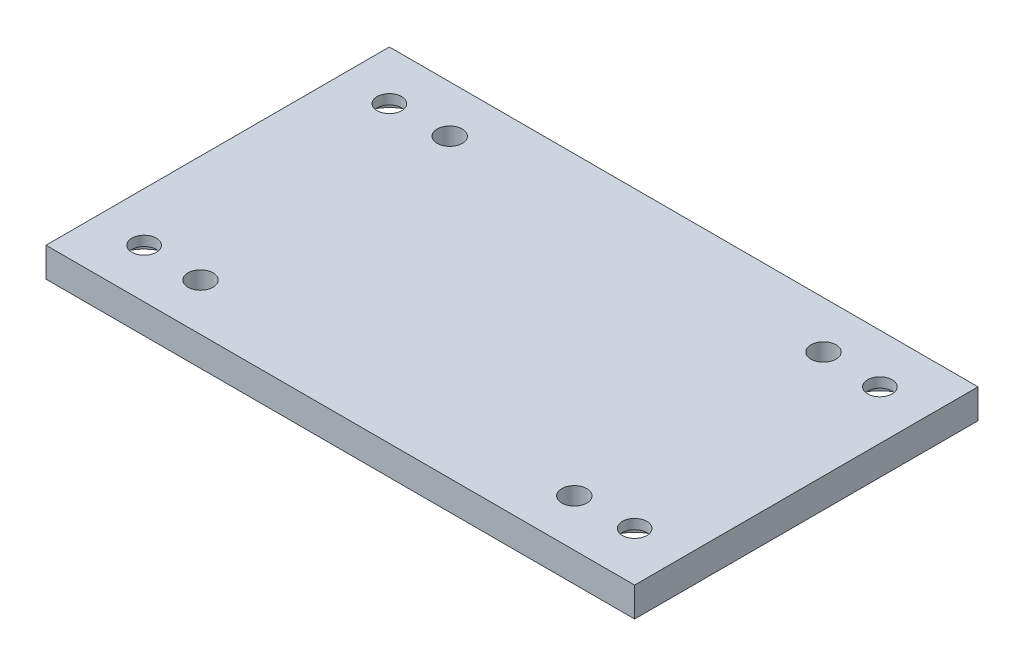
ISO-10303-21;
HEADER;
FILE_DESCRIPTION(('STEP AP214'),'2;1');
FILE_NAME('part.step','',(''),(''),'','','');
FILE_SCHEMA(('AUTOMOTIVE_DESIGN { 1 0 10303 214 1 1 1 1 }'));
ENDSEC;
DATA;
#1=APPLICATION_CONTEXT('core data for automotive mechanical design processes');
#2=APPLICATION_PROTOCOL_DEFINITION('international standard','automotive_design',2000,#1);
#3=PRODUCT_CONTEXT('',#1,'mechanical');
#4=PRODUCT('Part','Part','',(#3));
#5=PRODUCT_RELATED_PRODUCT_CATEGORY('part','',(#4));
#6=PRODUCT_DEFINITION_FORMATION('','',#4);
#7=PRODUCT_DEFINITION_CONTEXT('part definition',#1,'design');
#8=PRODUCT_DEFINITION('design','',#6,#7);
#9=PRODUCT_DEFINITION_SHAPE('','',#8);
#10=(LENGTH_UNIT() NAMED_UNIT(*) SI_UNIT(.MILLI.,.METRE.));
#11=(NAMED_UNIT(*) PLANE_ANGLE_UNIT() SI_UNIT($,.RADIAN.));
#12=(NAMED_UNIT(*) SI_UNIT($,.STERADIAN.) SOLID_ANGLE_UNIT());
#13=UNCERTAINTY_MEASURE_WITH_UNIT(LENGTH_MEASURE(1.E-05),#10,'distance_accuracy_value','');
#14=(GEOMETRIC_REPRESENTATION_CONTEXT(3) GLOBAL_UNCERTAINTY_ASSIGNED_CONTEXT((#13)) GLOBAL_UNIT_ASSIGNED_CONTEXT((#10,
#11,#12)) REPRESENTATION_CONTEXT('',''));
#15=CARTESIAN_POINT('',(0.,0.,0.));
#16=DIRECTION('',(0.,0.,1.));
#17=DIRECTION('',(1.,0.,0.));
#18=AXIS2_PLACEMENT_3D('',#15,#16,#17);
#19=CARTESIAN_POINT('',(-50.,6.,25.));
#20=DIRECTION('',(0.,-1.,0.));
#21=DIRECTION('',(0.,0.,-1.));
#22=AXIS2_PLACEMENT_3D('',#19,#20,#21);
#23=CYLINDRICAL_SURFACE('',#22,2.49999999999999);
#24=CARTESIAN_POINT('',(-50.,6.,25.));
#25=DIRECTION('',(0.,1.,0.));
#26=DIRECTION('',(0.,0.,1.));
#27=AXIS2_PLACEMENT_3D('',#24,#25,#26);
#28=CIRCLE('',#27,2.49999999999999);
#29=CARTESIAN_POINT('',(-50.,6.,27.5));
#30=VERTEX_POINT('',#29);
#31=EDGE_CURVE('E122',#30,#30,#28,.T.);
#32=ORIENTED_EDGE('',*,*,#31,.T.);
#33=EDGE_LOOP('',(#32));
#34=FACE_BOUND('',#33,.T.);
#35=CARTESIAN_POINT('',(-50.,4.,25.));
#36=DIRECTION('',(0.,-1.,0.));
#37=DIRECTION('',(0.,0.,-1.));
#38=AXIS2_PLACEMENT_3D('',#35,#36,#37);
#39=CIRCLE('',#38,2.49999999999999);
#40=CARTESIAN_POINT('',(-50.,4.,22.5));
#41=VERTEX_POINT('',#40);
#42=EDGE_CURVE('E49',#41,#41,#39,.T.);
#43=ORIENTED_EDGE('',*,*,#42,.T.);
#44=EDGE_LOOP('',(#43));
#45=FACE_BOUND('',#44,.T.);
#46=ADVANCED_FACE('F45',(#34,#45),#23,.F.);
#47=CARTESIAN_POINT('',(50.,6.,-25.));
#48=DIRECTION('',(0.,-1.,0.));
#49=DIRECTION('',(0.,0.,-1.));
#50=AXIS2_PLACEMENT_3D('',#47,#48,#49);
#51=CYLINDRICAL_SURFACE('',#50,2.49999999999999);
#52=CARTESIAN_POINT('',(50.,6.,-25.));
#53=DIRECTION('',(0.,1.,0.));
#54=DIRECTION('',(0.,0.,1.));
#55=AXIS2_PLACEMENT_3D('',#52,#53,#54);
#56=CIRCLE('',#55,2.49999999999999);
#57=CARTESIAN_POINT('',(50.,6.,-22.5));
#58=VERTEX_POINT('',#57);
#59=EDGE_CURVE('E190',#58,#58,#56,.T.);
#60=ORIENTED_EDGE('',*,*,#59,.T.);
#61=EDGE_LOOP('',(#60));
#62=FACE_BOUND('',#61,.T.);
#63=CARTESIAN_POINT('',(50.,4.,-25.));
#64=DIRECTION('',(0.,-1.,0.));
#65=DIRECTION('',(0.,0.,-1.));
#66=AXIS2_PLACEMENT_3D('',#63,#64,#65);
#67=CIRCLE('',#66,2.49999999999999);
#68=CARTESIAN_POINT('',(50.,4.,-27.5));
#69=VERTEX_POINT('',#68);
#70=EDGE_CURVE('E137',#69,#69,#67,.T.);
#71=ORIENTED_EDGE('',*,*,#70,.T.);
#72=EDGE_LOOP('',(#71));
#73=FACE_BOUND('',#72,.T.);
#74=ADVANCED_FACE('F206',(#62,#73),#51,.F.);
#75=CARTESIAN_POINT('',(0.,6.,0.));
#76=DIRECTION('',(0.,1.,0.));
#77=DIRECTION('',(0.,0.,1.));
#78=AXIS2_PLACEMENT_3D('',#75,#76,#77);
#79=PLANE('',#78);
#80=CARTESIAN_POINT('',(38.1,6.,-25.4));
#81=DIRECTION('',(0.,-1.,0.));
#82=DIRECTION('',(0.,0.,-1.));
#83=AXIS2_PLACEMENT_3D('',#80,#81,#82);
#84=CIRCLE('',#83,2.555);
#85=CARTESIAN_POINT('',(38.1,6.,-27.955));
#86=VERTEX_POINT('',#85);
#87=EDGE_CURVE('E153',#86,#86,#84,.T.);
#88=ORIENTED_EDGE('',*,*,#87,.T.);
#89=EDGE_LOOP('',(#88));
#90=FACE_BOUND('',#89,.T.);
#91=CARTESIAN_POINT('',(-38.1,6.,25.4));
#92=DIRECTION('',(0.,1.,0.));
#93=DIRECTION('',(0.,0.,1.));
#94=AXIS2_PLACEMENT_3D('',#91,#92,#93);
#95=CIRCLE('',#94,2.555);
#96=CARTESIAN_POINT('',(-38.1,6.,27.955));
#97=VERTEX_POINT('',#96);
#98=EDGE_CURVE('E167',#97,#97,#95,.T.);
#99=ORIENTED_EDGE('',*,*,#98,.F.);
#100=EDGE_LOOP('',(#99));
#101=FACE_BOUND('',#100,.T.);
#102=ORIENTED_EDGE('',*,*,#59,.F.);
#103=EDGE_LOOP('',(#102));
#104=FACE_BOUND('',#103,.T.);
#105=ORIENTED_EDGE('',*,*,#31,.F.);
#106=EDGE_LOOP('',(#105));
#107=FACE_BOUND('',#106,.T.);
#108=DIRECTION('',(0.,0.,-1.));
#109=VECTOR('',#108,1.);
#110=CARTESIAN_POINT('',(60.,6.,-35.));
#111=LINE('',#110,#109);
#112=CARTESIAN_POINT('',(60.,6.,35.));
#113=VERTEX_POINT('',#112);
#114=CARTESIAN_POINT('',(60.,6.,-35.));
#115=VERTEX_POINT('',#114);
#116=EDGE_CURVE('E101',#113,#115,#111,.T.);
#117=ORIENTED_EDGE('',*,*,#116,.T.);
#118=DIRECTION('',(-1.,0.,0.));
#119=VECTOR('',#118,1.);
#120=CARTESIAN_POINT('',(-60.,6.,-35.));
#121=LINE('',#120,#119);
#122=CARTESIAN_POINT('',(-60.,6.,-35.));
#123=VERTEX_POINT('',#122);
#124=EDGE_CURVE('E95',#115,#123,#121,.T.);
#125=ORIENTED_EDGE('',*,*,#124,.T.);
#126=DIRECTION('',(0.,0.,1.));
#127=VECTOR('',#126,1.);
#128=CARTESIAN_POINT('',(-60.,6.,-35.));
#129=LINE('',#128,#127);
#130=CARTESIAN_POINT('',(-60.,6.,35.));
#131=VERTEX_POINT('',#130);
#132=EDGE_CURVE('E99',#123,#131,#129,.T.);
#133=ORIENTED_EDGE('',*,*,#132,.T.);
#134=DIRECTION('',(1.,0.,0.));
#135=VECTOR('',#134,1.);
#136=CARTESIAN_POINT('',(-60.,6.,35.));
#137=LINE('',#136,#135);
#138=EDGE_CURVE('E65',#131,#113,#137,.T.);
#139=ORIENTED_EDGE('',*,*,#138,.T.);
#140=EDGE_LOOP('',(#117,#125,#133,#139));
#141=FACE_BOUND('',#140,.T.);
#142=CARTESIAN_POINT('',(-50.,6.,-25.));
#143=DIRECTION('',(0.,1.,0.));
#144=DIRECTION('',(0.,0.,-1.));
#145=AXIS2_PLACEMENT_3D('',#142,#143,#144);
#146=CIRCLE('',#145,2.49999999999999);
#147=CARTESIAN_POINT('',(-50.,6.,-27.5));
#148=VERTEX_POINT('',#147);
#149=EDGE_CURVE('E194',#148,#148,#146,.T.);
#150=ORIENTED_EDGE('',*,*,#149,.F.);
#151=EDGE_LOOP('',(#150));
#152=FACE_BOUND('',#151,.T.);
#153=CARTESIAN_POINT('',(50.,6.,25.));
#154=DIRECTION('',(0.,1.,0.));
#155=DIRECTION('',(0.,0.,-1.));
#156=AXIS2_PLACEMENT_3D('',#153,#154,#155);
#157=CIRCLE('',#156,2.49999999999999);
#158=CARTESIAN_POINT('',(50.,6.,22.5));
#159=VERTEX_POINT('',#158);
#160=EDGE_CURVE('E183',#159,#159,#157,.T.);
#161=ORIENTED_EDGE('',*,*,#160,.F.);
#162=EDGE_LOOP('',(#161));
#163=FACE_BOUND('',#162,.T.);
#164=CARTESIAN_POINT('',(38.1,6.,25.4));
#165=DIRECTION('',(0.,1.,0.));
#166=DIRECTION('',(0.,0.,1.));
#167=AXIS2_PLACEMENT_3D('',#164,#165,#166);
#168=CIRCLE('',#167,2.555);
#169=CARTESIAN_POINT('',(38.1,6.,27.955));
#170=VERTEX_POINT('',#169);
#171=EDGE_CURVE('E172',#170,#170,#168,.T.);
#172=ORIENTED_EDGE('',*,*,#171,.F.);
#173=EDGE_LOOP('',(#172));
#174=FACE_BOUND('',#173,.T.);
#175=CARTESIAN_POINT('',(-38.1,6.,-25.4));
#176=DIRECTION('',(0.,-1.,0.));
#177=DIRECTION('',(0.,0.,-1.));
#178=AXIS2_PLACEMENT_3D('',#175,#176,#177);
#179=CIRCLE('',#178,2.555);
#180=CARTESIAN_POINT('',(-38.1,6.,-27.955));
#181=VERTEX_POINT('',#180);
#182=EDGE_CURVE('E163',#181,#181,#179,.T.);
#183=ORIENTED_EDGE('',*,*,#182,.T.);
#184=EDGE_LOOP('',(#183));
#185=FACE_BOUND('',#184,.T.);
#186=ADVANCED_FACE('F96',(#90,#101,#104,#107,#141,#152,#163,#174,#185),#79,.T.);
#187=CARTESIAN_POINT('',(0.,0.,0.));
#188=DIRECTION('',(0.,1.,0.));
#189=DIRECTION('',(0.,0.,1.));
#190=AXIS2_PLACEMENT_3D('',#187,#188,#189);
#191=PLANE('',#190);
#192=CARTESIAN_POINT('',(-50.,0.,25.));
#193=DIRECTION('',(0.,1.,0.));
#194=DIRECTION('',(0.,0.,-1.));
#195=AXIS2_PLACEMENT_3D('',#192,#193,#194);
#196=CIRCLE('',#195,7.50000000000001);
#197=CARTESIAN_POINT('',(-50.,0.,17.5));
#198=VERTEX_POINT('',#197);
#199=EDGE_CURVE('E304',#198,#198,#196,.T.);
#200=ORIENTED_EDGE('',*,*,#199,.T.);
#201=EDGE_LOOP('',(#200));
#202=FACE_BOUND('',#201,.T.);
#203=CARTESIAN_POINT('',(50.,0.,25.));
#204=DIRECTION('',(0.,1.,0.));
#205=DIRECTION('',(0.,0.,1.));
#206=AXIS2_PLACEMENT_3D('',#203,#204,#205);
#207=CIRCLE('',#206,7.50000000000001);
#208=CARTESIAN_POINT('',(50.,0.,32.5));
#209=VERTEX_POINT('',#208);
#210=EDGE_CURVE('E294',#209,#209,#207,.T.);
#211=ORIENTED_EDGE('',*,*,#210,.T.);
#212=EDGE_LOOP('',(#211));
#213=FACE_BOUND('',#212,.T.);
#214=CARTESIAN_POINT('',(50.,0.,-25.));
#215=DIRECTION('',(0.,1.,0.));
#216=DIRECTION('',(0.,0.,-1.));
#217=AXIS2_PLACEMENT_3D('',#214,#215,#216);
#218=CIRCLE('',#217,7.50000000000001);
#219=CARTESIAN_POINT('',(50.,0.,-32.5));
#220=VERTEX_POINT('',#219);
#221=EDGE_CURVE('E286',#220,#220,#218,.T.);
#222=ORIENTED_EDGE('',*,*,#221,.T.);
#223=EDGE_LOOP('',(#222));
#224=FACE_BOUND('',#223,.T.);
#225=CARTESIAN_POINT('',(-50.,0.,-25.));
#226=DIRECTION('',(0.,1.,0.));
#227=DIRECTION('',(0.,0.,1.));
#228=AXIS2_PLACEMENT_3D('',#225,#226,#227);
#229=CIRCLE('',#228,7.50000000000001);
#230=CARTESIAN_POINT('',(-50.,0.,-17.5));
#231=VERTEX_POINT('',#230);
#232=EDGE_CURVE('E289',#231,#231,#229,.T.);
#233=ORIENTED_EDGE('',*,*,#232,.T.);
#234=EDGE_LOOP('',(#233));
#235=FACE_BOUND('',#234,.T.);
#236=CARTESIAN_POINT('',(38.1,0.,25.4));
#237=DIRECTION('',(0.,1.,0.));
#238=DIRECTION('',(0.,0.,1.));
#239=AXIS2_PLACEMENT_3D('',#236,#237,#238);
#240=CIRCLE('',#239,2.555);
#241=CARTESIAN_POINT('',(38.1,0.,27.955));
#242=VERTEX_POINT('',#241);
#243=EDGE_CURVE('E159',#242,#242,#240,.T.);
#244=ORIENTED_EDGE('',*,*,#243,.T.);
#245=EDGE_LOOP('',(#244));
#246=FACE_BOUND('',#245,.T.);
#247=CARTESIAN_POINT('',(-38.1,0.,25.4));
#248=DIRECTION('',(0.,1.,0.));
#249=DIRECTION('',(0.,0.,1.));
#250=AXIS2_PLACEMENT_3D('',#247,#248,#249);
#251=CIRCLE('',#250,2.555);
#252=CARTESIAN_POINT('',(-38.1,0.,27.955));
#253=VERTEX_POINT('',#252);
#254=EDGE_CURVE('E179',#253,#253,#251,.T.);
#255=ORIENTED_EDGE('',*,*,#254,.T.);
#256=EDGE_LOOP('',(#255));
#257=FACE_BOUND('',#256,.T.);
#258=DIRECTION('',(0.,0.,-1.));
#259=VECTOR('',#258,1.);
#260=CARTESIAN_POINT('',(60.,0.,-35.));
#261=LINE('',#260,#259);
#262=CARTESIAN_POINT('',(60.,0.,35.));
#263=VERTEX_POINT('',#262);
#264=CARTESIAN_POINT('',(60.,0.,-35.));
#265=VERTEX_POINT('',#264);
#266=EDGE_CURVE('E118',#263,#265,#261,.T.);
#267=ORIENTED_EDGE('',*,*,#266,.F.);
#268=DIRECTION('',(1.,0.,0.));
#269=VECTOR('',#268,1.);
#270=CARTESIAN_POINT('',(-60.,0.,35.));
#271=LINE('',#270,#269);
#272=CARTESIAN_POINT('',(-60.,0.,35.));
#273=VERTEX_POINT('',#272);
#274=EDGE_CURVE('E88',#273,#263,#271,.T.);
#275=ORIENTED_EDGE('',*,*,#274,.F.);
#276=DIRECTION('',(0.,0.,1.));
#277=VECTOR('',#276,1.);
#278=CARTESIAN_POINT('',(-60.,0.,-35.));
#279=LINE('',#278,#277);
#280=CARTESIAN_POINT('',(-60.,0.,-35.));
#281=VERTEX_POINT('',#280);
#282=EDGE_CURVE('E82',#281,#273,#279,.T.);
#283=ORIENTED_EDGE('',*,*,#282,.F.);
#284=DIRECTION('',(-1.,0.,0.));
#285=VECTOR('',#284,1.);
#286=CARTESIAN_POINT('',(-60.,0.,-35.));
#287=LINE('',#286,#285);
#288=EDGE_CURVE('E106',#265,#281,#287,.T.);
#289=ORIENTED_EDGE('',*,*,#288,.F.);
#290=EDGE_LOOP('',(#267,#275,#283,#289));
#291=FACE_BOUND('',#290,.T.);
#292=CARTESIAN_POINT('',(38.1,0.,-25.4));
#293=DIRECTION('',(0.,-1.,0.));
#294=DIRECTION('',(0.,0.,-1.));
#295=AXIS2_PLACEMENT_3D('',#292,#293,#294);
#296=CIRCLE('',#295,2.555);
#297=CARTESIAN_POINT('',(38.1,0.,-27.955));
#298=VERTEX_POINT('',#297);
#299=EDGE_CURVE('E148',#298,#298,#296,.T.);
#300=ORIENTED_EDGE('',*,*,#299,.F.);
#301=EDGE_LOOP('',(#300));
#302=FACE_BOUND('',#301,.T.);
#303=CARTESIAN_POINT('',(-38.1,0.,-25.4));
#304=DIRECTION('',(0.,-1.,0.));
#305=DIRECTION('',(0.,0.,-1.));
#306=AXIS2_PLACEMENT_3D('',#303,#304,#305);
#307=CIRCLE('',#306,2.555);
#308=CARTESIAN_POINT('',(-38.1,0.,-27.955));
#309=VERTEX_POINT('',#308);
#310=EDGE_CURVE('E168',#309,#309,#307,.T.);
#311=ORIENTED_EDGE('',*,*,#310,.F.);
#312=EDGE_LOOP('',(#311));
#313=FACE_BOUND('',#312,.T.);
#314=ADVANCED_FACE('F205',(#202,#213,#224,#235,#246,#257,#291,#302,#313),#191,.F.);
#315=CARTESIAN_POINT('',(60.,6.,-35.));
#316=DIRECTION('',(-1.,0.,0.));
#317=DIRECTION('',(0.,0.,1.));
#318=AXIS2_PLACEMENT_3D('',#315,#316,#317);
#319=PLANE('',#318);
#320=ORIENTED_EDGE('',*,*,#266,.T.);
#321=DIRECTION('',(0.,-1.,0.));
#322=VECTOR('',#321,1.);
#323=CARTESIAN_POINT('',(60.,6.,-35.));
#324=LINE('',#323,#322);
#325=EDGE_CURVE('E11',#115,#265,#324,.T.);
#326=ORIENTED_EDGE('',*,*,#325,.F.);
#327=ORIENTED_EDGE('',*,*,#116,.F.);
#328=DIRECTION('',(0.,-1.,0.));
#329=VECTOR('',#328,1.);
#330=CARTESIAN_POINT('',(60.,6.,35.));
#331=LINE('',#330,#329);
#332=EDGE_CURVE('E114',#113,#263,#331,.T.);
#333=ORIENTED_EDGE('',*,*,#332,.T.);
#334=EDGE_LOOP('',(#320,#326,#327,#333));
#335=FACE_BOUND('',#334,.T.);
#336=ADVANCED_FACE('F47',(#335),#319,.F.);
#337=CARTESIAN_POINT('',(-60.,6.,-35.));
#338=DIRECTION('',(0.,0.,1.));
#339=DIRECTION('',(1.,0.,0.));
#340=AXIS2_PLACEMENT_3D('',#337,#338,#339);
#341=PLANE('',#340);
#342=ORIENTED_EDGE('',*,*,#288,.T.);
#343=DIRECTION('',(0.,-1.,0.));
#344=VECTOR('',#343,1.);
#345=CARTESIAN_POINT('',(-60.,6.,-35.));
#346=LINE('',#345,#344);
#347=EDGE_CURVE('E56',#123,#281,#346,.T.);
#348=ORIENTED_EDGE('',*,*,#347,.F.);
#349=ORIENTED_EDGE('',*,*,#124,.F.);
#350=ORIENTED_EDGE('',*,*,#325,.T.);
#351=EDGE_LOOP('',(#342,#348,#349,#350));
#352=FACE_BOUND('',#351,.T.);
#353=ADVANCED_FACE('F105',(#352),#341,.F.);
#354=CARTESIAN_POINT('',(-60.,6.,-35.));
#355=DIRECTION('',(1.,0.,0.));
#356=DIRECTION('',(0.,0.,-1.));
#357=AXIS2_PLACEMENT_3D('',#354,#355,#356);
#358=PLANE('',#357);
#359=ORIENTED_EDGE('',*,*,#282,.T.);
#360=DIRECTION('',(0.,-1.,0.));
#361=VECTOR('',#360,1.);
#362=CARTESIAN_POINT('',(-60.,6.,35.));
#363=LINE('',#362,#361);
#364=EDGE_CURVE('E108',#131,#273,#363,.T.);
#365=ORIENTED_EDGE('',*,*,#364,.F.);
#366=ORIENTED_EDGE('',*,*,#132,.F.);
#367=ORIENTED_EDGE('',*,*,#347,.T.);
#368=EDGE_LOOP('',(#359,#365,#366,#367));
#369=FACE_BOUND('',#368,.T.);
#370=ADVANCED_FACE('F110',(#369),#358,.F.);
#371=CARTESIAN_POINT('',(-60.,6.,35.));
#372=DIRECTION('',(0.,0.,-1.));
#373=DIRECTION('',(-1.,0.,0.));
#374=AXIS2_PLACEMENT_3D('',#371,#372,#373);
#375=PLANE('',#374);
#376=ORIENTED_EDGE('',*,*,#274,.T.);
#377=ORIENTED_EDGE('',*,*,#332,.F.);
#378=ORIENTED_EDGE('',*,*,#138,.F.);
#379=ORIENTED_EDGE('',*,*,#364,.T.);
#380=EDGE_LOOP('',(#376,#377,#378,#379));
#381=FACE_BOUND('',#380,.T.);
#382=ADVANCED_FACE('F229',(#381),#375,.F.);
#383=CARTESIAN_POINT('',(-50.,6.,-25.));
#384=DIRECTION('',(0.,-1.,0.));
#385=DIRECTION('',(0.,0.,-1.));
#386=AXIS2_PLACEMENT_3D('',#383,#384,#385);
#387=CYLINDRICAL_SURFACE('',#386,2.49999999999999);
#388=CARTESIAN_POINT('',(-50.,4.,-25.));
#389=DIRECTION('',(0.,1.,0.));
#390=DIRECTION('',(0.,0.,1.));
#391=AXIS2_PLACEMENT_3D('',#388,#389,#390);
#392=CIRCLE('',#391,2.49999999999999);
#393=CARTESIAN_POINT('',(-50.,4.,-22.5));
#394=VERTEX_POINT('',#393);
#395=EDGE_CURVE('E141',#394,#394,#392,.T.);
#396=ORIENTED_EDGE('',*,*,#395,.F.);
#397=EDGE_LOOP('',(#396));
#398=FACE_BOUND('',#397,.T.);
#399=ORIENTED_EDGE('',*,*,#149,.T.);
#400=EDGE_LOOP('',(#399));
#401=FACE_BOUND('',#400,.T.);
#402=ADVANCED_FACE('F226',(#398,#401),#387,.F.);
#403=CARTESIAN_POINT('',(50.,6.,25.));
#404=DIRECTION('',(0.,-1.,0.));
#405=DIRECTION('',(0.,0.,-1.));
#406=AXIS2_PLACEMENT_3D('',#403,#404,#405);
#407=CYLINDRICAL_SURFACE('',#406,2.49999999999999);
#408=CARTESIAN_POINT('',(50.,4.,25.));
#409=DIRECTION('',(0.,1.,0.));
#410=DIRECTION('',(0.,0.,1.));
#411=AXIS2_PLACEMENT_3D('',#408,#409,#410);
#412=CIRCLE('',#411,2.49999999999999);
#413=CARTESIAN_POINT('',(50.,4.,27.5));
#414=VERTEX_POINT('',#413);
#415=EDGE_CURVE('E133',#414,#414,#412,.T.);
#416=ORIENTED_EDGE('',*,*,#415,.F.);
#417=EDGE_LOOP('',(#416));
#418=FACE_BOUND('',#417,.T.);
#419=ORIENTED_EDGE('',*,*,#160,.T.);
#420=EDGE_LOOP('',(#419));
#421=FACE_BOUND('',#420,.T.);
#422=ADVANCED_FACE('F228',(#418,#421),#407,.F.);
#423=CARTESIAN_POINT('',(-38.1,0.,25.4));
#424=DIRECTION('',(0.,1.,0.));
#425=DIRECTION('',(0.,0.,1.));
#426=AXIS2_PLACEMENT_3D('',#423,#424,#425);
#427=CYLINDRICAL_SURFACE('',#426,2.555);
#428=ORIENTED_EDGE('',*,*,#254,.F.);
#429=EDGE_LOOP('',(#428));
#430=FACE_BOUND('',#429,.T.);
#431=ORIENTED_EDGE('',*,*,#98,.T.);
#432=EDGE_LOOP('',(#431));
#433=FACE_BOUND('',#432,.T.);
#434=ADVANCED_FACE('F234',(#430,#433),#427,.F.);
#435=CARTESIAN_POINT('',(38.1,0.,-25.4));
#436=DIRECTION('',(0.,1.,0.));
#437=DIRECTION('',(0.,0.,1.));
#438=AXIS2_PLACEMENT_3D('',#435,#436,#437);
#439=CYLINDRICAL_SURFACE('',#438,2.555);
#440=ORIENTED_EDGE('',*,*,#299,.T.);
#441=EDGE_LOOP('',(#440));
#442=FACE_BOUND('',#441,.T.);
#443=ORIENTED_EDGE('',*,*,#87,.F.);
#444=EDGE_LOOP('',(#443));
#445=FACE_BOUND('',#444,.T.);
#446=ADVANCED_FACE('F237',(#442,#445),#439,.F.);
#447=CARTESIAN_POINT('',(38.1,0.,25.4));
#448=DIRECTION('',(0.,1.,0.));
#449=DIRECTION('',(0.,0.,1.));
#450=AXIS2_PLACEMENT_3D('',#447,#448,#449);
#451=CYLINDRICAL_SURFACE('',#450,2.555);
#452=ORIENTED_EDGE('',*,*,#243,.F.);
#453=EDGE_LOOP('',(#452));
#454=FACE_BOUND('',#453,.T.);
#455=ORIENTED_EDGE('',*,*,#171,.T.);
#456=EDGE_LOOP('',(#455));
#457=FACE_BOUND('',#456,.T.);
#458=ADVANCED_FACE('F239',(#454,#457),#451,.F.);
#459=CARTESIAN_POINT('',(-38.1,0.,-25.4));
#460=DIRECTION('',(0.,1.,0.));
#461=DIRECTION('',(0.,0.,1.));
#462=AXIS2_PLACEMENT_3D('',#459,#460,#461);
#463=CYLINDRICAL_SURFACE('',#462,2.555);
#464=ORIENTED_EDGE('',*,*,#310,.T.);
#465=EDGE_LOOP('',(#464));
#466=FACE_BOUND('',#465,.T.);
#467=ORIENTED_EDGE('',*,*,#182,.F.);
#468=EDGE_LOOP('',(#467));
#469=FACE_BOUND('',#468,.T.);
#470=ADVANCED_FACE('F242',(#466,#469),#463,.F.);
#471=CARTESIAN_POINT('',(50.,4.,25.));
#472=DIRECTION('',(0.,-1.,0.));
#473=DIRECTION('',(0.,0.,-1.));
#474=AXIS2_PLACEMENT_3D('',#471,#472,#473);
#475=CYLINDRICAL_SURFACE('',#474,7.50000000000001);
#476=CARTESIAN_POINT('',(50.,4.,25.));
#477=DIRECTION('',(0.,1.,0.));
#478=DIRECTION('',(0.,0.,1.));
#479=AXIS2_PLACEMENT_3D('',#476,#477,#478);
#480=CIRCLE('',#479,7.50000000000001);
#481=CARTESIAN_POINT('',(50.,4.,32.5));
#482=VERTEX_POINT('',#481);
#483=EDGE_CURVE('E300',#482,#482,#480,.T.);
#484=ORIENTED_EDGE('',*,*,#483,.T.);
#485=EDGE_LOOP('',(#484));
#486=FACE_BOUND('',#485,.T.);
#487=ORIENTED_EDGE('',*,*,#210,.F.);
#488=EDGE_LOOP('',(#487));
#489=FACE_BOUND('',#488,.T.);
#490=ADVANCED_FACE('F245',(#486,#489),#475,.F.);
#491=CARTESIAN_POINT('',(50.,4.,25.));
#492=DIRECTION('',(0.,1.,0.));
#493=DIRECTION('',(0.,0.,1.));
#494=AXIS2_PLACEMENT_3D('',#491,#492,#493);
#495=PLANE('',#494);
#496=ORIENTED_EDGE('',*,*,#415,.T.);
#497=EDGE_LOOP('',(#496));
#498=FACE_BOUND('',#497,.T.);
#499=ORIENTED_EDGE('',*,*,#483,.F.);
#500=EDGE_LOOP('',(#499));
#501=FACE_BOUND('',#500,.T.);
#502=ADVANCED_FACE('F265',(#498,#501),#495,.F.);
#503=CARTESIAN_POINT('',(50.,4.,-25.));
#504=DIRECTION('',(0.,-1.,0.));
#505=DIRECTION('',(0.,0.,-1.));
#506=AXIS2_PLACEMENT_3D('',#503,#504,#505);
#507=CYLINDRICAL_SURFACE('',#506,7.50000000000001);
#508=CARTESIAN_POINT('',(50.,4.,-25.));
#509=DIRECTION('',(0.,1.,0.));
#510=DIRECTION('',(0.,0.,-1.));
#511=AXIS2_PLACEMENT_3D('',#508,#509,#510);
#512=CIRCLE('',#511,7.50000000000001);
#513=CARTESIAN_POINT('',(50.,4.,-32.5));
#514=VERTEX_POINT('',#513);
#515=EDGE_CURVE('E283',#514,#514,#512,.T.);
#516=ORIENTED_EDGE('',*,*,#515,.T.);
#517=EDGE_LOOP('',(#516));
#518=FACE_BOUND('',#517,.T.);
#519=ORIENTED_EDGE('',*,*,#221,.F.);
#520=EDGE_LOOP('',(#519));
#521=FACE_BOUND('',#520,.T.);
#522=ADVANCED_FACE('F268',(#518,#521),#507,.F.);
#523=CARTESIAN_POINT('',(50.,4.,-25.));
#524=DIRECTION('',(0.,-1.,0.));
#525=DIRECTION('',(0.,0.,-1.));
#526=AXIS2_PLACEMENT_3D('',#523,#524,#525);
#527=PLANE('',#526);
#528=ORIENTED_EDGE('',*,*,#70,.F.);
#529=EDGE_LOOP('',(#528));
#530=FACE_BOUND('',#529,.T.);
#531=ORIENTED_EDGE('',*,*,#515,.F.);
#532=EDGE_LOOP('',(#531));
#533=FACE_BOUND('',#532,.T.);
#534=ADVANCED_FACE('F253',(#530,#533),#527,.T.);
#535=CARTESIAN_POINT('',(-50.,4.,-25.));
#536=DIRECTION('',(0.,-1.,0.));
#537=DIRECTION('',(0.,0.,-1.));
#538=AXIS2_PLACEMENT_3D('',#535,#536,#537);
#539=CYLINDRICAL_SURFACE('',#538,7.50000000000001);
#540=CARTESIAN_POINT('',(-50.,4.,-25.));
#541=DIRECTION('',(0.,1.,0.));
#542=DIRECTION('',(0.,0.,1.));
#543=AXIS2_PLACEMENT_3D('',#540,#541,#542);
#544=CIRCLE('',#543,7.50000000000001);
#545=CARTESIAN_POINT('',(-50.,4.,-17.5));
#546=VERTEX_POINT('',#545);
#547=EDGE_CURVE('E138',#546,#546,#544,.T.);
#548=ORIENTED_EDGE('',*,*,#547,.T.);
#549=EDGE_LOOP('',(#548));
#550=FACE_BOUND('',#549,.T.);
#551=ORIENTED_EDGE('',*,*,#232,.F.);
#552=EDGE_LOOP('',(#551));
#553=FACE_BOUND('',#552,.T.);
#554=ADVANCED_FACE('F249',(#550,#553),#539,.F.);
#555=CARTESIAN_POINT('',(-50.,4.,-25.));
#556=DIRECTION('',(0.,1.,0.));
#557=DIRECTION('',(0.,0.,1.));
#558=AXIS2_PLACEMENT_3D('',#555,#556,#557);
#559=PLANE('',#558);
#560=ORIENTED_EDGE('',*,*,#395,.T.);
#561=EDGE_LOOP('',(#560));
#562=FACE_BOUND('',#561,.T.);
#563=ORIENTED_EDGE('',*,*,#547,.F.);
#564=EDGE_LOOP('',(#563));
#565=FACE_BOUND('',#564,.T.);
#566=ADVANCED_FACE('F252',(#562,#565),#559,.F.);
#567=CARTESIAN_POINT('',(-50.,4.,25.));
#568=DIRECTION('',(0.,-1.,0.));
#569=DIRECTION('',(0.,0.,-1.));
#570=AXIS2_PLACEMENT_3D('',#567,#568,#569);
#571=CYLINDRICAL_SURFACE('',#570,7.50000000000001);
#572=CARTESIAN_POINT('',(-50.,4.,25.));
#573=DIRECTION('',(0.,1.,0.));
#574=DIRECTION('',(0.,0.,-1.));
#575=AXIS2_PLACEMENT_3D('',#572,#573,#574);
#576=CIRCLE('',#575,7.50000000000001);
#577=CARTESIAN_POINT('',(-50.,4.,17.5));
#578=VERTEX_POINT('',#577);
#579=EDGE_CURVE('E308',#578,#578,#576,.T.);
#580=ORIENTED_EDGE('',*,*,#579,.T.);
#581=EDGE_LOOP('',(#580));
#582=FACE_BOUND('',#581,.T.);
#583=ORIENTED_EDGE('',*,*,#199,.F.);
#584=EDGE_LOOP('',(#583));
#585=FACE_BOUND('',#584,.T.);
#586=ADVANCED_FACE('F257',(#582,#585),#571,.F.);
#587=CARTESIAN_POINT('',(-50.,4.,25.));
#588=DIRECTION('',(0.,-1.,0.));
#589=DIRECTION('',(0.,0.,-1.));
#590=AXIS2_PLACEMENT_3D('',#587,#588,#589);
#591=PLANE('',#590);
#592=ORIENTED_EDGE('',*,*,#42,.F.);
#593=EDGE_LOOP('',(#592));
#594=FACE_BOUND('',#593,.T.);
#595=ORIENTED_EDGE('',*,*,#579,.F.);
#596=EDGE_LOOP('',(#595));
#597=FACE_BOUND('',#596,.T.);
#598=ADVANCED_FACE('F258',(#594,#597),#591,.T.);
#599=CLOSED_SHELL('',(#46,#74,#186,#314,#336,#353,#370,#382,#402,#422,#434,#446,#458,#470,#490,
#502,#522,#534,#554,#566,#586,#598));
#600=MANIFOLD_SOLID_BREP('B2',#599);
#601=ADVANCED_BREP_SHAPE_REPRESENTATION('',(#18,#600),#14);
#602=SHAPE_DEFINITION_REPRESENTATION(#9,#601);
ENDSEC;
END-ISO-10303-21;
